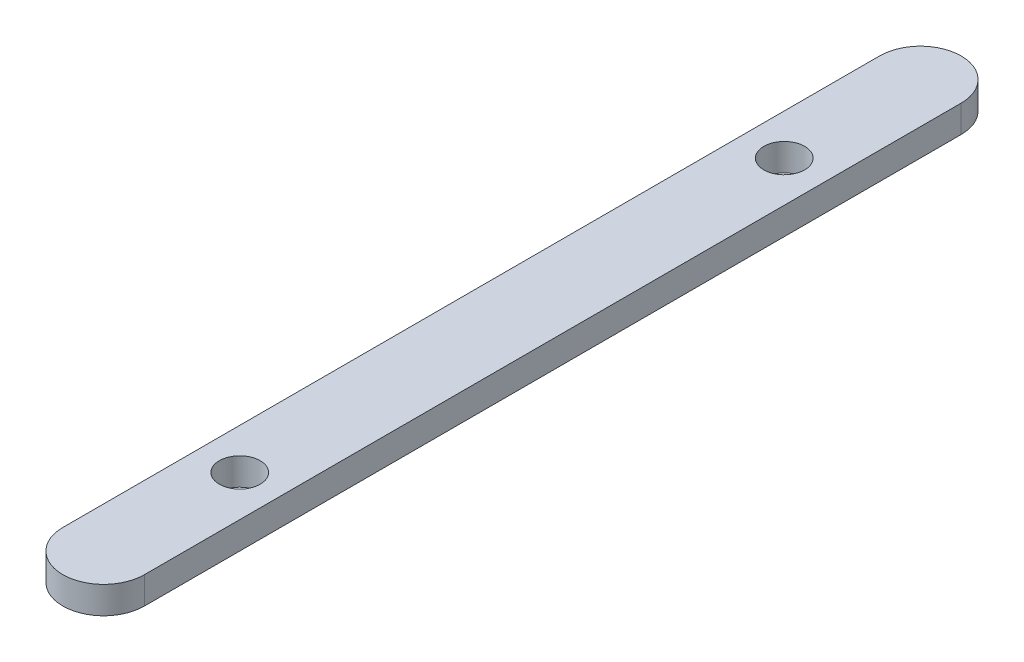
ISO-10303-21;
HEADER;
FILE_DESCRIPTION(('STEP AP214'),'2;1');
FILE_NAME('part.step','',(''),(''),'','','');
FILE_SCHEMA(('AUTOMOTIVE_DESIGN { 1 0 10303 214 1 1 1 1 }'));
ENDSEC;
DATA;
#1=APPLICATION_CONTEXT('core data for automotive mechanical design processes');
#2=APPLICATION_PROTOCOL_DEFINITION('international standard','automotive_design',2000,#1);
#3=PRODUCT_CONTEXT('',#1,'mechanical');
#4=PRODUCT('Part','Part','',(#3));
#5=PRODUCT_RELATED_PRODUCT_CATEGORY('part','',(#4));
#6=PRODUCT_DEFINITION_FORMATION('','',#4);
#7=PRODUCT_DEFINITION_CONTEXT('part definition',#1,'design');
#8=PRODUCT_DEFINITION('design','',#6,#7);
#9=PRODUCT_DEFINITION_SHAPE('','',#8);
#10=(LENGTH_UNIT() NAMED_UNIT(*) SI_UNIT(.MILLI.,.METRE.));
#11=(NAMED_UNIT(*) PLANE_ANGLE_UNIT() SI_UNIT($,.RADIAN.));
#12=(NAMED_UNIT(*) SI_UNIT($,.STERADIAN.) SOLID_ANGLE_UNIT());
#13=UNCERTAINTY_MEASURE_WITH_UNIT(LENGTH_MEASURE(1.E-05),#10,'distance_accuracy_value','');
#14=(GEOMETRIC_REPRESENTATION_CONTEXT(3) GLOBAL_UNCERTAINTY_ASSIGNED_CONTEXT((#13)) GLOBAL_UNIT_ASSIGNED_CONTEXT((#10,
#11,#12)) REPRESENTATION_CONTEXT('',''));
#15=CARTESIAN_POINT('',(0.,0.,0.));
#16=DIRECTION('',(0.,0.,1.));
#17=DIRECTION('',(1.,0.,0.));
#18=AXIS2_PLACEMENT_3D('',#15,#16,#17);
#19=CARTESIAN_POINT('',(3.00000000000003,2.,0.));
#20=DIRECTION('',(1.,0.,0.));
#21=DIRECTION('',(0.,0.,-1.));
#22=AXIS2_PLACEMENT_3D('',#19,#20,#21);
#23=PLANE('',#22);
#24=DIRECTION('',(0.,0.,1.));
#25=VECTOR('',#24,1.);
#26=CARTESIAN_POINT('',(3.00000000000003,0.,0.));
#27=LINE('',#26,#25);
#28=CARTESIAN_POINT('',(3.00000000000003,0.,-30.));
#29=VERTEX_POINT('',#28);
#30=CARTESIAN_POINT('',(3.00000000000003,0.,30.));
#31=VERTEX_POINT('',#30);
#32=EDGE_CURVE('E112',#29,#31,#27,.T.);
#33=ORIENTED_EDGE('',*,*,#32,.F.);
#34=DIRECTION('',(0.,-1.,0.));
#35=VECTOR('',#34,1.);
#36=CARTESIAN_POINT('',(3.00000000000003,2.,-30.));
#37=LINE('',#36,#35);
#38=CARTESIAN_POINT('',(3.00000000000003,2.,-30.));
#39=VERTEX_POINT('',#38);
#40=EDGE_CURVE('E11',#39,#29,#37,.T.);
#41=ORIENTED_EDGE('',*,*,#40,.F.);
#42=DIRECTION('',(0.,0.,1.));
#43=VECTOR('',#42,1.);
#44=CARTESIAN_POINT('',(3.00000000000003,2.,0.));
#45=LINE('',#44,#43);
#46=CARTESIAN_POINT('',(3.00000000000003,2.,30.));
#47=VERTEX_POINT('',#46);
#48=EDGE_CURVE('E99',#39,#47,#45,.T.);
#49=ORIENTED_EDGE('',*,*,#48,.T.);
#50=DIRECTION('',(0.,-1.,0.));
#51=VECTOR('',#50,1.);
#52=CARTESIAN_POINT('',(3.00000000000003,2.,30.));
#53=LINE('',#52,#51);
#54=EDGE_CURVE('E78',#47,#31,#53,.T.);
#55=ORIENTED_EDGE('',*,*,#54,.T.);
#56=EDGE_LOOP('',(#33,#41,#49,#55));
#57=FACE_BOUND('',#56,.T.);
#58=ADVANCED_FACE('F38',(#57),#23,.T.);
#59=CARTESIAN_POINT('',(0.,2.,-30.));
#60=DIRECTION('',(0.,-1.,0.));
#61=DIRECTION('',(0.,0.,-1.));
#62=AXIS2_PLACEMENT_3D('',#59,#60,#61);
#63=CYLINDRICAL_SURFACE('',#62,3.);
#64=CARTESIAN_POINT('',(0.,0.,-30.));
#65=DIRECTION('',(0.,1.,0.));
#66=DIRECTION('',(0.,0.,1.));
#67=AXIS2_PLACEMENT_3D('',#64,#65,#66);
#68=CIRCLE('',#67,3.);
#69=CARTESIAN_POINT('',(-2.99999999999997,0.,-30.));
#70=VERTEX_POINT('',#69);
#71=EDGE_CURVE('E90',#70,#29,#68,.F.);
#72=ORIENTED_EDGE('',*,*,#71,.F.);
#73=DIRECTION('',(0.,-1.,0.));
#74=VECTOR('',#73,1.);
#75=CARTESIAN_POINT('',(-2.99999999999997,2.,-30.));
#76=LINE('',#75,#74);
#77=CARTESIAN_POINT('',(-2.99999999999997,2.,-30.));
#78=VERTEX_POINT('',#77);
#79=EDGE_CURVE('E47',#78,#70,#76,.T.);
#80=ORIENTED_EDGE('',*,*,#79,.F.);
#81=CARTESIAN_POINT('',(0.,2.,-30.));
#82=DIRECTION('',(0.,1.,0.));
#83=DIRECTION('',(0.,0.,1.));
#84=AXIS2_PLACEMENT_3D('',#81,#82,#83);
#85=CIRCLE('',#84,3.);
#86=EDGE_CURVE('E88',#78,#39,#85,.F.);
#87=ORIENTED_EDGE('',*,*,#86,.T.);
#88=ORIENTED_EDGE('',*,*,#40,.T.);
#89=EDGE_LOOP('',(#72,#80,#87,#88));
#90=FACE_BOUND('',#89,.T.);
#91=ADVANCED_FACE('F86',(#90),#63,.T.);
#92=CARTESIAN_POINT('',(-2.99999999999998,2.,0.));
#93=DIRECTION('',(1.,0.,0.));
#94=DIRECTION('',(0.,0.,-1.));
#95=AXIS2_PLACEMENT_3D('',#92,#93,#94);
#96=PLANE('',#95);
#97=DIRECTION('',(0.,0.,1.));
#98=VECTOR('',#97,1.);
#99=CARTESIAN_POINT('',(-2.99999999999998,0.,0.));
#100=LINE('',#99,#98);
#101=CARTESIAN_POINT('',(-2.99999999999998,0.,30.));
#102=VERTEX_POINT('',#101);
#103=EDGE_CURVE('E115',#70,#102,#100,.T.);
#104=ORIENTED_EDGE('',*,*,#103,.T.);
#105=DIRECTION('',(0.,-1.,0.));
#106=VECTOR('',#105,1.);
#107=CARTESIAN_POINT('',(-2.99999999999998,2.,30.));
#108=LINE('',#107,#106);
#109=CARTESIAN_POINT('',(-2.99999999999998,2.,30.));
#110=VERTEX_POINT('',#109);
#111=EDGE_CURVE('E93',#110,#102,#108,.T.);
#112=ORIENTED_EDGE('',*,*,#111,.F.);
#113=DIRECTION('',(0.,0.,1.));
#114=VECTOR('',#113,1.);
#115=CARTESIAN_POINT('',(-2.99999999999998,2.,0.));
#116=LINE('',#115,#114);
#117=EDGE_CURVE('E95',#78,#110,#116,.T.);
#118=ORIENTED_EDGE('',*,*,#117,.F.);
#119=ORIENTED_EDGE('',*,*,#79,.T.);
#120=EDGE_LOOP('',(#104,#112,#118,#119));
#121=FACE_BOUND('',#120,.T.);
#122=ADVANCED_FACE('F96',(#121),#96,.F.);
#123=CARTESIAN_POINT('',(0.,2.,-20.));
#124=DIRECTION('',(0.,-1.,0.));
#125=DIRECTION('',(0.,0.,-1.));
#126=AXIS2_PLACEMENT_3D('',#123,#124,#125);
#127=CYLINDRICAL_SURFACE('',#126,1.5);
#128=CARTESIAN_POINT('',(0.,2.,-20.));
#129=DIRECTION('',(0.,1.,0.));
#130=DIRECTION('',(0.,0.,1.));
#131=AXIS2_PLACEMENT_3D('',#128,#129,#130);
#132=CIRCLE('',#131,1.5);
#133=CARTESIAN_POINT('',(0.,2.,-18.5));
#134=VERTEX_POINT('',#133);
#135=EDGE_CURVE('E101',#134,#134,#132,.T.);
#136=ORIENTED_EDGE('',*,*,#135,.T.);
#137=EDGE_LOOP('',(#136));
#138=FACE_BOUND('',#137,.T.);
#139=CARTESIAN_POINT('',(0.,0.,-20.));
#140=DIRECTION('',(0.,1.,0.));
#141=DIRECTION('',(0.,0.,1.));
#142=AXIS2_PLACEMENT_3D('',#139,#140,#141);
#143=CIRCLE('',#142,1.5);
#144=CARTESIAN_POINT('',(0.,0.,-18.5));
#145=VERTEX_POINT('',#144);
#146=EDGE_CURVE('E109',#145,#145,#143,.T.);
#147=ORIENTED_EDGE('',*,*,#146,.F.);
#148=EDGE_LOOP('',(#147));
#149=FACE_BOUND('',#148,.T.);
#150=ADVANCED_FACE('F130',(#138,#149),#127,.F.);
#151=CARTESIAN_POINT('',(0.,2.,20.));
#152=DIRECTION('',(0.,-1.,0.));
#153=DIRECTION('',(0.,0.,-1.));
#154=AXIS2_PLACEMENT_3D('',#151,#152,#153);
#155=CYLINDRICAL_SURFACE('',#154,1.5);
#156=CARTESIAN_POINT('',(0.,2.,20.));
#157=DIRECTION('',(0.,1.,0.));
#158=DIRECTION('',(0.,0.,1.));
#159=AXIS2_PLACEMENT_3D('',#156,#157,#158);
#160=CIRCLE('',#159,1.5);
#161=CARTESIAN_POINT('',(0.,2.,21.5));
#162=VERTEX_POINT('',#161);
#163=EDGE_CURVE('E118',#162,#162,#160,.T.);
#164=ORIENTED_EDGE('',*,*,#163,.T.);
#165=EDGE_LOOP('',(#164));
#166=FACE_BOUND('',#165,.T.);
#167=CARTESIAN_POINT('',(0.,0.,20.));
#168=DIRECTION('',(0.,1.,0.));
#169=DIRECTION('',(0.,0.,1.));
#170=AXIS2_PLACEMENT_3D('',#167,#168,#169);
#171=CIRCLE('',#170,1.5);
#172=CARTESIAN_POINT('',(0.,0.,21.5));
#173=VERTEX_POINT('',#172);
#174=EDGE_CURVE('E106',#173,#173,#171,.T.);
#175=ORIENTED_EDGE('',*,*,#174,.F.);
#176=EDGE_LOOP('',(#175));
#177=FACE_BOUND('',#176,.T.);
#178=ADVANCED_FACE('F40',(#166,#177),#155,.F.);
#179=CARTESIAN_POINT('',(0.,2.,30.));
#180=DIRECTION('',(0.,-1.,0.));
#181=DIRECTION('',(0.,0.,-1.));
#182=AXIS2_PLACEMENT_3D('',#179,#180,#181);
#183=CYLINDRICAL_SURFACE('',#182,3.00000000000001);
#184=CARTESIAN_POINT('',(0.,0.,30.));
#185=DIRECTION('',(0.,1.,0.));
#186=DIRECTION('',(0.,0.,1.));
#187=AXIS2_PLACEMENT_3D('',#184,#185,#186);
#188=CIRCLE('',#187,3.00000000000001);
#189=EDGE_CURVE('E71',#102,#31,#188,.T.);
#190=ORIENTED_EDGE('',*,*,#189,.T.);
#191=ORIENTED_EDGE('',*,*,#54,.F.);
#192=CARTESIAN_POINT('',(0.,2.,30.));
#193=DIRECTION('',(0.,1.,0.));
#194=DIRECTION('',(0.,0.,1.));
#195=AXIS2_PLACEMENT_3D('',#192,#193,#194);
#196=CIRCLE('',#195,3.00000000000001);
#197=EDGE_CURVE('E55',#110,#47,#196,.T.);
#198=ORIENTED_EDGE('',*,*,#197,.F.);
#199=ORIENTED_EDGE('',*,*,#111,.T.);
#200=EDGE_LOOP('',(#190,#191,#198,#199));
#201=FACE_BOUND('',#200,.T.);
#202=ADVANCED_FACE('F121',(#201),#183,.T.);
#203=CARTESIAN_POINT('',(0.,2.,0.));
#204=DIRECTION('',(0.,1.,0.));
#205=DIRECTION('',(0.,0.,1.));
#206=AXIS2_PLACEMENT_3D('',#203,#204,#205);
#207=PLANE('',#206);
#208=ORIENTED_EDGE('',*,*,#163,.F.);
#209=EDGE_LOOP('',(#208));
#210=FACE_BOUND('',#209,.T.);
#211=ORIENTED_EDGE('',*,*,#135,.F.);
#212=EDGE_LOOP('',(#211));
#213=FACE_BOUND('',#212,.T.);
#214=ORIENTED_EDGE('',*,*,#48,.F.);
#215=ORIENTED_EDGE('',*,*,#86,.F.);
#216=ORIENTED_EDGE('',*,*,#117,.T.);
#217=ORIENTED_EDGE('',*,*,#197,.T.);
#218=EDGE_LOOP('',(#214,#215,#216,#217));
#219=FACE_BOUND('',#218,.T.);
#220=ADVANCED_FACE('F98',(#210,#213,#219),#207,.T.);
#221=CARTESIAN_POINT('',(0.,0.,0.));
#222=DIRECTION('',(0.,1.,0.));
#223=DIRECTION('',(0.,0.,1.));
#224=AXIS2_PLACEMENT_3D('',#221,#222,#223);
#225=PLANE('',#224);
#226=ORIENTED_EDGE('',*,*,#174,.T.);
#227=EDGE_LOOP('',(#226));
#228=FACE_BOUND('',#227,.T.);
#229=ORIENTED_EDGE('',*,*,#146,.T.);
#230=EDGE_LOOP('',(#229));
#231=FACE_BOUND('',#230,.T.);
#232=ORIENTED_EDGE('',*,*,#32,.T.);
#233=ORIENTED_EDGE('',*,*,#189,.F.);
#234=ORIENTED_EDGE('',*,*,#103,.F.);
#235=ORIENTED_EDGE('',*,*,#71,.T.);
#236=EDGE_LOOP('',(#232,#233,#234,#235));
#237=FACE_BOUND('',#236,.T.);
#238=ADVANCED_FACE('F122',(#228,#231,#237),#225,.F.);
#239=CLOSED_SHELL('',(#58,#91,#122,#150,#178,#202,#220,#238));
#240=MANIFOLD_SOLID_BREP('B2',#239);
#241=ADVANCED_BREP_SHAPE_REPRESENTATION('',(#18,#240),#14);
#242=SHAPE_DEFINITION_REPRESENTATION(#9,#241);
ENDSEC;
END-ISO-10303-21;
